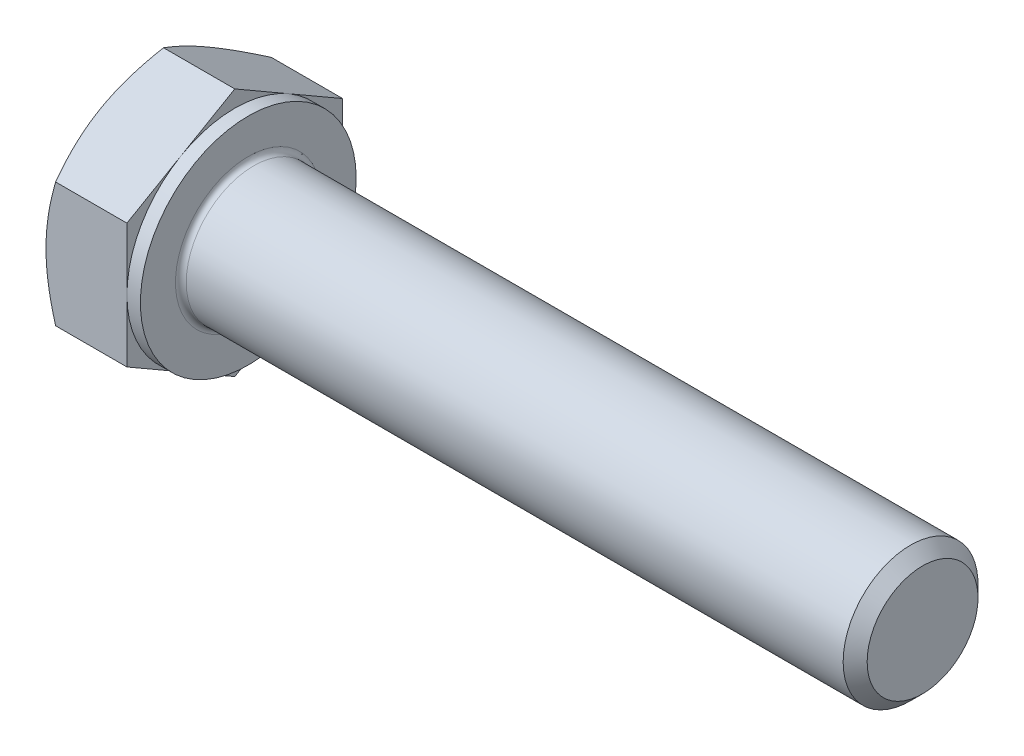
ISO-10303-21;
HEADER;
FILE_DESCRIPTION(('STEP AP214'),'2;1');
FILE_NAME('part.step','',(''),(''),'','','');
FILE_SCHEMA(('AUTOMOTIVE_DESIGN { 1 0 10303 214 1 1 1 1 }'));
ENDSEC;
DATA;
#1=APPLICATION_CONTEXT('core data for automotive mechanical design processes');
#2=APPLICATION_PROTOCOL_DEFINITION('international standard','automotive_design',2000,#1);
#3=PRODUCT_CONTEXT('',#1,'mechanical');
#4=PRODUCT('Part','Part','',(#3));
#5=PRODUCT_RELATED_PRODUCT_CATEGORY('part','',(#4));
#6=PRODUCT_DEFINITION_FORMATION('','',#4);
#7=PRODUCT_DEFINITION_CONTEXT('part definition',#1,'design');
#8=PRODUCT_DEFINITION('design','',#6,#7);
#9=PRODUCT_DEFINITION_SHAPE('','',#8);
#10=(LENGTH_UNIT() NAMED_UNIT(*) SI_UNIT(.MILLI.,.METRE.));
#11=(NAMED_UNIT(*) PLANE_ANGLE_UNIT() SI_UNIT($,.RADIAN.));
#12=(NAMED_UNIT(*) SI_UNIT($,.STERADIAN.) SOLID_ANGLE_UNIT());
#13=UNCERTAINTY_MEASURE_WITH_UNIT(LENGTH_MEASURE(1.E-05),#10,'distance_accuracy_value','');
#14=(GEOMETRIC_REPRESENTATION_CONTEXT(3) GLOBAL_UNCERTAINTY_ASSIGNED_CONTEXT((#13)) GLOBAL_UNIT_ASSIGNED_CONTEXT((#10,
#11,#12)) REPRESENTATION_CONTEXT('',''));
#15=CARTESIAN_POINT('',(0.,0.,0.));
#16=DIRECTION('',(0.,0.,1.));
#17=DIRECTION('',(1.,0.,0.));
#18=AXIS2_PLACEMENT_3D('',#15,#16,#17);
#19=CARTESIAN_POINT('',(3.5,4.61880215351701,0.));
#20=DIRECTION('',(1.,0.,0.));
#21=DIRECTION('',(0.,0.,-1.));
#22=AXIS2_PLACEMENT_3D('',#19,#20,#21);
#23=PLANE('',#22);
#24=CARTESIAN_POINT('',(3.5,0.,0.));
#25=DIRECTION('',(1.,0.,0.));
#26=DIRECTION('',(0.,0.,-1.));
#27=AXIS2_PLACEMENT_3D('',#24,#25,#26);
#28=CIRCLE('',#27,2.7);
#29=CARTESIAN_POINT('',(3.5,0.,-2.7));
#30=VERTEX_POINT('',#29);
#31=EDGE_CURVE('E43',#30,#30,#28,.F.);
#32=ORIENTED_EDGE('',*,*,#31,.T.);
#33=EDGE_LOOP('',(#32));
#34=FACE_BOUND('',#33,.T.);
#35=CARTESIAN_POINT('',(3.5,0.,0.));
#36=DIRECTION('',(1.,0.,0.));
#37=DIRECTION('',(0.,0.,-1.));
#38=AXIS2_PLACEMENT_3D('',#35,#36,#37);
#39=CIRCLE('',#38,4.);
#40=CARTESIAN_POINT('',(3.5,0.,-4.));
#41=VERTEX_POINT('',#40);
#42=EDGE_CURVE('E294',#41,#41,#39,.T.);
#43=ORIENTED_EDGE('',*,*,#42,.T.);
#44=EDGE_LOOP('',(#43));
#45=FACE_BOUND('',#44,.T.);
#46=ADVANCED_FACE('F35',(#34,#45),#23,.T.);
#47=CARTESIAN_POINT('',(0.,0.,0.));
#48=DIRECTION('',(-1.,0.,0.));
#49=DIRECTION('',(0.,0.,1.));
#50=AXIS2_PLACEMENT_3D('',#47,#48,#49);
#51=CYLINDRICAL_SURFACE('',#50,2.5);
#52=CARTESIAN_POINT('',(3.7,0.,0.));
#53=DIRECTION('',(1.,0.,0.));
#54=DIRECTION('',(0.,0.,-1.));
#55=AXIS2_PLACEMENT_3D('',#52,#53,#54);
#56=CIRCLE('',#55,2.5);
#57=CARTESIAN_POINT('',(3.7,0.,-2.5));
#58=VERTEX_POINT('',#57);
#59=EDGE_CURVE('E11',#58,#58,#56,.T.);
#60=ORIENTED_EDGE('',*,*,#59,.T.);
#61=EDGE_LOOP('',(#60));
#62=FACE_BOUND('',#61,.T.);
#63=CARTESIAN_POINT('',(28.0550000000001,0.,0.));
#64=DIRECTION('',(-1.,0.,0.));
#65=DIRECTION('',(0.,0.,1.));
#66=AXIS2_PLACEMENT_3D('',#63,#64,#65);
#67=CIRCLE('',#66,2.5);
#68=CARTESIAN_POINT('',(28.0550000000001,0.,2.5));
#69=VERTEX_POINT('',#68);
#70=EDGE_CURVE('E273',#69,#69,#67,.T.);
#71=ORIENTED_EDGE('',*,*,#70,.T.);
#72=EDGE_LOOP('',(#71));
#73=FACE_BOUND('',#72,.T.);
#74=ADVANCED_FACE('F247',(#62,#73),#51,.T.);
#75=CARTESIAN_POINT('',(28.5,0.,0.));
#76=DIRECTION('',(-1.,0.,0.));
#77=DIRECTION('',(0.,0.,1.));
#78=AXIS2_PLACEMENT_3D('',#75,#76,#77);
#79=CONICAL_SURFACE('',#78,2.055,0.785398163397513);
#80=ORIENTED_EDGE('',*,*,#70,.F.);
#81=EDGE_LOOP('',(#80));
#82=FACE_BOUND('',#81,.T.);
#83=CARTESIAN_POINT('',(28.5,0.,0.));
#84=DIRECTION('',(-1.,0.,0.));
#85=DIRECTION('',(0.,0.,1.));
#86=AXIS2_PLACEMENT_3D('',#83,#84,#85);
#87=CIRCLE('',#86,2.055);
#88=CARTESIAN_POINT('',(28.5,0.,2.055));
#89=VERTEX_POINT('',#88);
#90=EDGE_CURVE('E271',#89,#89,#87,.T.);
#91=ORIENTED_EDGE('',*,*,#90,.T.);
#92=EDGE_LOOP('',(#91));
#93=FACE_BOUND('',#92,.T.);
#94=ADVANCED_FACE('F252',(#82,#93),#79,.T.);
#95=CARTESIAN_POINT('',(28.5,0.,0.));
#96=DIRECTION('',(-1.,0.,0.));
#97=DIRECTION('',(0.,0.,1.));
#98=AXIS2_PLACEMENT_3D('',#95,#96,#97);
#99=PLANE('',#98);
#100=ORIENTED_EDGE('',*,*,#90,.F.);
#101=EDGE_LOOP('',(#100));
#102=FACE_BOUND('',#101,.T.);
#103=ADVANCED_FACE('F259',(#102),#99,.F.);
#104=CARTESIAN_POINT('',(3.,4.,0.));
#105=DIRECTION('',(1.,0.,0.));
#106=DIRECTION('',(0.,0.,-1.));
#107=AXIS2_PLACEMENT_3D('',#104,#105,#106);
#108=PLANE('',#107);
#109=DIRECTION('',(0.,0.500000000000001,0.866025403784438));
#110=VECTOR('',#109,1.);
#111=CARTESIAN_POINT('',(3.,2.3094010767585,-4.));
#112=LINE('',#111,#110);
#113=CARTESIAN_POINT('',(3.,2.3094010767585,-4.));
#114=VERTEX_POINT('',#113);
#115=CARTESIAN_POINT('',(3.,3.46410161513775,-2.00000000000001));
#116=VERTEX_POINT('',#115);
#117=EDGE_CURVE('E167',#114,#116,#112,.T.);
#118=ORIENTED_EDGE('',*,*,#117,.T.);
#119=CARTESIAN_POINT('',(3.,0.,0.));
#120=DIRECTION('',(-1.,0.,0.));
#121=DIRECTION('',(0.,0.,1.));
#122=AXIS2_PLACEMENT_3D('',#119,#120,#121);
#123=CIRCLE('',#122,4.);
#124=CARTESIAN_POINT('',(3.,0.,-4.));
#125=VERTEX_POINT('',#124);
#126=EDGE_CURVE('E50',#116,#125,#123,.T.);
#127=ORIENTED_EDGE('',*,*,#126,.T.);
#128=DIRECTION('',(0.,1.,0.));
#129=VECTOR('',#128,1.);
#130=CARTESIAN_POINT('',(3.,2.3094010767585,-4.));
#131=LINE('',#130,#129);
#132=EDGE_CURVE('E297',#125,#114,#131,.T.);
#133=ORIENTED_EDGE('',*,*,#132,.T.);
#134=EDGE_LOOP('',(#118,#127,#133));
#135=FACE_BOUND('',#134,.T.);
#136=ADVANCED_FACE('F262',(#135),#108,.T.);
#137=CARTESIAN_POINT('',(3.,4.61880215351701,0.));
#138=VERTEX_POINT('',#137);
#139=EDGE_CURVE('E165',#116,#138,#112,.T.);
#140=ORIENTED_EDGE('',*,*,#139,.T.);
#141=DIRECTION('',(0.,-0.500000000000001,0.866025403784438));
#142=VECTOR('',#141,1.);
#143=CARTESIAN_POINT('',(3.,4.61880215351701,0.));
#144=LINE('',#143,#142);
#145=CARTESIAN_POINT('',(3.,3.46410161513775,2.));
#146=VERTEX_POINT('',#145);
#147=EDGE_CURVE('E164',#138,#146,#144,.T.);
#148=ORIENTED_EDGE('',*,*,#147,.T.);
#149=EDGE_CURVE('E153',#146,#116,#123,.T.);
#150=ORIENTED_EDGE('',*,*,#149,.T.);
#151=EDGE_LOOP('',(#140,#148,#150));
#152=FACE_BOUND('',#151,.T.);
#153=ADVANCED_FACE('F267',(#152),#108,.T.);
#154=CARTESIAN_POINT('',(3.,2.30940107675851,3.99999999999999));
#155=VERTEX_POINT('',#154);
#156=EDGE_CURVE('E132',#146,#155,#144,.T.);
#157=ORIENTED_EDGE('',*,*,#156,.T.);
#158=DIRECTION('',(0.,-1.,0.));
#159=VECTOR('',#158,1.);
#160=CARTESIAN_POINT('',(3.,2.30940107675851,3.99999999999999));
#161=LINE('',#160,#159);
#162=CARTESIAN_POINT('',(3.,0.,4.));
#163=VERTEX_POINT('',#162);
#164=EDGE_CURVE('E126',#155,#163,#161,.T.);
#165=ORIENTED_EDGE('',*,*,#164,.T.);
#166=EDGE_CURVE('E130',#163,#146,#123,.T.);
#167=ORIENTED_EDGE('',*,*,#166,.T.);
#168=EDGE_LOOP('',(#157,#165,#167));
#169=FACE_BOUND('',#168,.T.);
#170=ADVANCED_FACE('F128',(#169),#108,.T.);
#171=CARTESIAN_POINT('',(3.,-2.30940107675848,3.99999999999999));
#172=VERTEX_POINT('',#171);
#173=EDGE_CURVE('E136',#163,#172,#161,.T.);
#174=ORIENTED_EDGE('',*,*,#173,.T.);
#175=DIRECTION('',(0.,-0.500000000000001,-0.866025403784438));
#176=VECTOR('',#175,1.);
#177=CARTESIAN_POINT('',(3.,-4.61880215351699,0.));
#178=LINE('',#177,#176);
#179=CARTESIAN_POINT('',(3.,-3.46410161513775,2.));
#180=VERTEX_POINT('',#179);
#181=EDGE_CURVE('E143',#172,#180,#178,.T.);
#182=ORIENTED_EDGE('',*,*,#181,.T.);
#183=EDGE_CURVE('E140',#180,#163,#123,.T.);
#184=ORIENTED_EDGE('',*,*,#183,.T.);
#185=EDGE_LOOP('',(#174,#182,#184));
#186=FACE_BOUND('',#185,.T.);
#187=ADVANCED_FACE('F141',(#186),#108,.T.);
#188=CARTESIAN_POINT('',(3.,-4.61880215351699,0.));
#189=VERTEX_POINT('',#188);
#190=EDGE_CURVE('E159',#180,#189,#178,.T.);
#191=ORIENTED_EDGE('',*,*,#190,.T.);
#192=DIRECTION('',(0.,0.499999999999998,-0.86602540378444));
#193=VECTOR('',#192,1.);
#194=CARTESIAN_POINT('',(3.,-2.3094010767585,-4.));
#195=LINE('',#194,#193);
#196=CARTESIAN_POINT('',(3.,-3.46410161513776,-1.99999999999999));
#197=VERTEX_POINT('',#196);
#198=EDGE_CURVE('E335',#189,#197,#195,.T.);
#199=ORIENTED_EDGE('',*,*,#198,.T.);
#200=EDGE_CURVE('E147',#197,#180,#123,.T.);
#201=ORIENTED_EDGE('',*,*,#200,.T.);
#202=EDGE_LOOP('',(#191,#199,#201));
#203=FACE_BOUND('',#202,.T.);
#204=ADVANCED_FACE('F336',(#203),#108,.T.);
#205=CARTESIAN_POINT('',(3.,-2.3094010767585,-4.));
#206=VERTEX_POINT('',#205);
#207=EDGE_CURVE('E154',#197,#206,#195,.T.);
#208=ORIENTED_EDGE('',*,*,#207,.T.);
#209=EDGE_CURVE('E298',#206,#125,#131,.T.);
#210=ORIENTED_EDGE('',*,*,#209,.T.);
#211=EDGE_CURVE('E305',#125,#197,#123,.T.);
#212=ORIENTED_EDGE('',*,*,#211,.T.);
#213=EDGE_LOOP('',(#208,#210,#212));
#214=FACE_BOUND('',#213,.T.);
#215=ADVANCED_FACE('F268',(#214),#108,.T.);
#216=CARTESIAN_POINT('',(0.,0.,0.));
#217=DIRECTION('',(-1.,0.,0.));
#218=DIRECTION('',(0.,0.,1.));
#219=AXIS2_PLACEMENT_3D('',#216,#217,#218);
#220=CYLINDRICAL_SURFACE('',#219,4.);
#221=ORIENTED_EDGE('',*,*,#126,.F.);
#222=ORIENTED_EDGE('',*,*,#149,.F.);
#223=ORIENTED_EDGE('',*,*,#166,.F.);
#224=ORIENTED_EDGE('',*,*,#183,.F.);
#225=ORIENTED_EDGE('',*,*,#200,.F.);
#226=ORIENTED_EDGE('',*,*,#211,.F.);
#227=EDGE_LOOP('',(#221,#222,#223,#224,#225,#226));
#228=FACE_BOUND('',#227,.T.);
#229=ORIENTED_EDGE('',*,*,#42,.F.);
#230=EDGE_LOOP('',(#229));
#231=FACE_BOUND('',#230,.T.);
#232=ADVANCED_FACE('F150',(#228,#231),#220,.T.);
#233=CARTESIAN_POINT('',(0.,4.61880215351701,0.));
#234=DIRECTION('',(1.,0.,0.));
#235=DIRECTION('',(0.,0.,-1.));
#236=AXIS2_PLACEMENT_3D('',#233,#234,#235);
#237=PLANE('',#236);
#238=CARTESIAN_POINT('',(0.,0.,0.));
#239=DIRECTION('',(1.,0.,0.));
#240=DIRECTION('',(0.,0.,-1.));
#241=AXIS2_PLACEMENT_3D('',#238,#239,#240);
#242=CIRCLE('',#241,4.);
#243=CARTESIAN_POINT('',(0.,0.,-4.));
#244=VERTEX_POINT('',#243);
#245=CARTESIAN_POINT('',(0.,3.46410161513775,-2.00000000000001));
#246=VERTEX_POINT('',#245);
#247=EDGE_CURVE('E293',#244,#246,#242,.T.);
#248=ORIENTED_EDGE('',*,*,#247,.F.);
#249=CARTESIAN_POINT('',(0.,-3.46410161513776,-1.99999999999999));
#250=VERTEX_POINT('',#249);
#251=EDGE_CURVE('E289',#250,#244,#242,.T.);
#252=ORIENTED_EDGE('',*,*,#251,.F.);
#253=CARTESIAN_POINT('',(0.,-3.46410161513775,2.));
#254=VERTEX_POINT('',#253);
#255=EDGE_CURVE('E292',#254,#250,#242,.T.);
#256=ORIENTED_EDGE('',*,*,#255,.F.);
#257=CARTESIAN_POINT('',(0.,0.,4.));
#258=VERTEX_POINT('',#257);
#259=EDGE_CURVE('E328',#258,#254,#242,.T.);
#260=ORIENTED_EDGE('',*,*,#259,.F.);
#261=CARTESIAN_POINT('',(0.,0.,0.));
#262=DIRECTION('',(-1.,0.,0.));
#263=DIRECTION('',(0.,0.,1.));
#264=AXIS2_PLACEMENT_3D('',#261,#262,#263);
#265=CIRCLE('',#264,4.);
#266=CARTESIAN_POINT('',(0.,3.46410161513775,2.));
#267=VERTEX_POINT('',#266);
#268=EDGE_CURVE('E168',#258,#267,#265,.T.);
#269=ORIENTED_EDGE('',*,*,#268,.T.);
#270=EDGE_CURVE('E351',#246,#267,#242,.T.);
#271=ORIENTED_EDGE('',*,*,#270,.F.);
#272=EDGE_LOOP('',(#248,#252,#256,#260,#269,#271));
#273=FACE_BOUND('',#272,.T.);
#274=ADVANCED_FACE('F197',(#273),#237,.F.);
#275=CARTESIAN_POINT('',(0.,0.,0.));
#276=DIRECTION('',(1.,0.,0.));
#277=DIRECTION('',(0.,0.,-1.));
#278=AXIS2_PLACEMENT_3D('',#275,#276,#277);
#279=CONICAL_SURFACE('',#278,4.,1.0471975511966);
#280=CARTESIAN_POINT('',(0.357332259074763,2.30928560670467,4.00019999999999));
#281=CARTESIAN_POINT('',(0.29871787364828,2.41077174646171,3.82442084967676));
#282=CARTESIAN_POINT('',(0.245410321462261,2.513133908835,3.64712438367361));
#283=CARTESIAN_POINT('',(0.152361670746402,2.71963072479812,3.28946140682429));
#284=CARTESIAN_POINT('',(0.112653489029703,2.82376904741905,3.10908854102984));
#285=CARTESIAN_POINT('',(0.050842215280279,3.03075510011796,2.7505781812972));
#286=CARTESIAN_POINT('',(0.0283277315228895,3.13357098372492,2.57249584706485));
#287=CARTESIAN_POINT('',(0.00145062314658324,3.33968651028529,2.21549328283349));
#288=CARTESIAN_POINT('',(-0.00293425857305535,3.44298540411435,2.03657435035589));
#289=CARTESIAN_POINT('',(0.00619007293997218,3.63600352522933,1.70225715780326));
#290=CARTESIAN_POINT('',(0.0174589539879966,3.72575165335065,1.54680884001293));
#291=CARTESIAN_POINT('',(0.0531739907981959,3.90466320392055,1.23692494436494));
#292=CARTESIAN_POINT('',(0.0776323457115357,3.99382600759479,1.08249043825587));
#293=CARTESIAN_POINT('',(0.138776064919292,4.17310641015198,0.771967672225419));
#294=CARTESIAN_POINT('',(0.175720603654867,4.26320131938132,0.615918711936895));
#295=CARTESIAN_POINT('',(0.25957007254803,4.44204742827551,0.306148164596159));
#296=CARTESIAN_POINT('',(0.306455302212743,4.53080091904967,0.15242260922622));
#297=CARTESIAN_POINT('',(0.35733225907477,4.61891762357085,-0.000200000000000259));
#298=B_SPLINE_CURVE_WITH_KNOTS('',3,(#280,#281,#282,#283,#284,#285,#286,#287,#288,#289,#290,
#291,#292,#293,#294,#295,#296,#297),.UNSPECIFIED.,.F.,.F.,(4,2,2,2,2,2,2,2,4),(0.,
0.634047835695966,1.26961969224543,1.88946157213122,2.50854226669297,3.04757825393385,
3.58711366126903,4.13861653143763,4.68903648037743),.UNSPECIFIED.);
#299=CARTESIAN_POINT('',(0.357265589908165,4.61880215351701,0.));
#300=VERTEX_POINT('',#299);
#301=EDGE_CURVE('E216',#267,#300,#298,.T.);
#302=ORIENTED_EDGE('',*,*,#301,.T.);
#303=CARTESIAN_POINT('',(0.357332259074769,4.61891762357085,0.0002));
#304=CARTESIAN_POINT('',(0.298717873648285,4.51743148381381,-0.175579150323228));
#305=CARTESIAN_POINT('',(0.245410321462265,4.41506932144052,-0.352875616326381));
#306=CARTESIAN_POINT('',(0.152361670746406,4.2085725054774,-0.710538593175707));
#307=CARTESIAN_POINT('',(0.112653489029706,4.10443418285647,-0.890911458970151));
#308=CARTESIAN_POINT('',(0.0508422152802806,3.89744813015756,-1.24942181870279));
#309=CARTESIAN_POINT('',(0.0283277315228902,3.7946322465506,-1.42750415293514));
#310=CARTESIAN_POINT('',(0.00145062314658287,3.58851671999023,-1.78450671716651));
#311=CARTESIAN_POINT('',(-0.00293425857305574,3.48521782616117,-1.9634256496441));
#312=CARTESIAN_POINT('',(0.00619007293997088,3.29219970504619,-2.29774284219673));
#313=CARTESIAN_POINT('',(0.0174589539879945,3.20245157692486,-2.45319115998707));
#314=CARTESIAN_POINT('',(0.0531739907981929,3.02354002635497,-2.76307505563506));
#315=CARTESIAN_POINT('',(0.0776323457115326,2.93437722268073,-2.91750956174413));
#316=CARTESIAN_POINT('',(0.138776064919289,2.75509682012354,-3.22803232777458));
#317=CARTESIAN_POINT('',(0.175720603654862,2.6650019108942,-3.3840812880631));
#318=CARTESIAN_POINT('',(0.259570072548025,2.48615580200001,-3.69385183540384));
#319=CARTESIAN_POINT('',(0.306455302212738,2.39740231122585,-3.84757739077378));
#320=CARTESIAN_POINT('',(0.357332259074765,2.30928560670466,-4.0002));
#321=B_SPLINE_CURVE_WITH_KNOTS('',3,(#303,#304,#305,#306,#307,#308,#309,#310,#311,#312,#313,
#314,#315,#316,#317,#318,#319,#320),.UNSPECIFIED.,.F.,.F.,(4,2,2,2,2,2,2,2,4),(0.,
0.634047835695967,1.26961969224543,1.88946157213122,2.50854226669297,3.04757825393386,
3.58711366126904,4.13861653143764,4.68903648037743),.UNSPECIFIED.);
#322=EDGE_CURVE('E58',#300,#246,#321,.T.);
#323=ORIENTED_EDGE('',*,*,#322,.T.);
#324=ORIENTED_EDGE('',*,*,#270,.T.);
#325=EDGE_LOOP('',(#302,#323,#324));
#326=FACE_BOUND('',#325,.T.);
#327=ADVANCED_FACE('F352',(#326),#279,.T.);
#328=CARTESIAN_POINT('',(2.00011120589741,-6.3020384276111,4.));
#329=CARTESIAN_POINT('',(1.91454696498874,-6.12645846908572,4.));
#330=CARTESIAN_POINT('',(1.82977515877991,-5.95048585830453,4.));
#331=CARTESIAN_POINT('',(1.66226027831944,-5.59754684504874,4.));
#332=CARTESIAN_POINT('',(1.57951750565516,-5.42058029958675,4.));
#333=CARTESIAN_POINT('',(1.41610926315702,-5.0645798535815,4.));
#334=CARTESIAN_POINT('',(1.33545672742031,-4.88553999633135,4.));
#335=CARTESIAN_POINT('',(1.17732358085362,-4.52607013308823,4.));
#336=CARTESIAN_POINT('',(1.09984282639236,-4.34564019048466,4.));
#337=CARTESIAN_POINT('',(0.946328318347805,-3.97695712450865,4.));
#338=CARTESIAN_POINT('',(0.87043270452968,-3.78864617668019,4.));
#339=CARTESIAN_POINT('',(0.724150215973379,-3.40985798992393,4.));
#340=CARTESIAN_POINT('',(0.653763945273161,-3.21938051607553,3.99999999999999));
#341=CARTESIAN_POINT('',(0.520275623504074,-2.83628177128503,3.99999999999999));
#342=CARTESIAN_POINT('',(0.457159651374145,-2.64366539864626,3.99999999999999));
#343=CARTESIAN_POINT('',(0.340171517554833,-2.25567134331567,3.99999999999999));
#344=CARTESIAN_POINT('',(0.286296547637712,-2.06029451909568,3.99999999999999));
#345=CARTESIAN_POINT('',(0.190596079795562,-1.6677501958015,3.99999999999999));
#346=CARTESIAN_POINT('',(0.148703055516459,-1.47059946092577,3.99999999999999));
#347=CARTESIAN_POINT('',(0.0792701945625757,-1.07374632347738,3.99999999999999));
#348=CARTESIAN_POINT('',(0.0517287925825685,-0.874044201614995,3.99999999999999));
#349=CARTESIAN_POINT('',(0.013551736981094,-0.475733691865649,3.99999999999999));
#350=CARTESIAN_POINT('',(0.00269106568149962,-0.277147418102497,3.99999999999999));
#351=CARTESIAN_POINT('',(-0.00180277185474003,0.120241437274135,3.99999999999999));
#352=CARTESIAN_POINT('',(0.0045643093544797,0.319044021953537,3.99999999999999));
#353=CARTESIAN_POINT('',(0.0293199842587296,0.653649133068303,3.99999999999999));
#354=CARTESIAN_POINT('',(0.0433487696608947,0.789796206499819,3.99999999999999));
#355=CARTESIAN_POINT('',(0.0786650587211727,1.0611517992991,3.99999999999999));
#356=CARTESIAN_POINT('',(0.0999534653997802,1.1963601997699,3.99999999999999));
#357=CARTESIAN_POINT('',(0.173595113230301,1.60036108975571,3.99999999999999));
#358=CARTESIAN_POINT('',(0.235713609865277,1.86739658303732,3.99999999999999));
#359=CARTESIAN_POINT('',(0.344187907647021,2.26690842404958,3.99999999999999));
#360=CARTESIAN_POINT('',(0.383434484333356,2.40143348571873,3.99999999999999));
#361=CARTESIAN_POINT('',(0.466191102609246,2.66917849490935,3.99999999999999));
#362=CARTESIAN_POINT('',(0.509701177188773,2.80239843232331,3.99999999999999));
#363=CARTESIAN_POINT('',(0.600271094434186,3.06757339383922,3.99999999999999));
#364=CARTESIAN_POINT('',(0.64732994386215,3.19952876030404,3.99999999999999));
#365=CARTESIAN_POINT('',(0.74442509663193,3.46233234223973,3.99999999999999));
#366=CARTESIAN_POINT('',(0.794461330917675,3.59318058330841,3.99999999999999));
#367=CARTESIAN_POINT('',(0.933355739925496,3.94627302392211,3.99999999999999));
#368=CARTESIAN_POINT('',(1.0245987610664,4.16757823857485,3.99999999999999));
#369=CARTESIAN_POINT('',(1.212472284956,4.60789849928791,3.99999999999999));
#370=CARTESIAN_POINT('',(1.30910339372387,4.82691328443149,3.99999999999999));
#371=CARTESIAN_POINT('',(1.50647026715799,5.26317250533755,3.99999999999999));
#372=CARTESIAN_POINT('',(1.60720747010151,5.4804162882198,3.99999999999999));
#373=CARTESIAN_POINT('',(1.81181128644257,5.91342831956034,3.99999999999999));
#374=CARTESIAN_POINT('',(1.91567799687904,6.12919652200916,3.99999999999999));
#375=CARTESIAN_POINT('',(2.12601769056008,6.55988022094133,3.99999999999999));
#376=CARTESIAN_POINT('',(2.23249454580639,6.77479382248027,3.99999999999999));
#377=CARTESIAN_POINT('',(2.44739203770408,7.20364803216284,3.99999999999999));
#378=CARTESIAN_POINT('',(2.55581269515436,7.41758862986447,3.99999999999999));
#379=CARTESIAN_POINT('',(2.88334503640577,8.05812603677695,3.99999999999999));
#380=CARTESIAN_POINT('',(3.10477549508713,8.48353660654958,3.99999999999999));
#381=CARTESIAN_POINT('',(3.52798949521967,9.28704830568598,3.99999999999999));
#382=CARTESIAN_POINT('',(3.72935795236481,9.66536913109685,3.99999999999999));
#383=CARTESIAN_POINT('',(4.13451859351915,10.4207405604373,3.99999999999999));
#384=CARTESIAN_POINT('',(4.33831092861574,10.7977910832853,3.99999999999999));
#385=CARTESIAN_POINT('',(4.74699525708428,11.5496417902084,3.99999999999999));
#386=CARTESIAN_POINT('',(4.95188119417862,11.9244452714923,3.99999999999999));
#387=CARTESIAN_POINT('',(5.36302659718326,12.6732594632005,3.99999999999999));
#388=CARTESIAN_POINT('',(5.56928595205575,13.0472702345666,3.99999999999999));
#389=CARTESIAN_POINT('',(5.7760450350038,13.42100281196,3.99999999999999));
#390=B_SPLINE_CURVE_WITH_KNOTS('',3,(#328,#329,#330,#331,#332,#333,#334,#335,#336,#337,#338,
#339,#340,#341,#342,#343,#344,#345,#346,#347,#348,#349,#350,#351,#352,#353,#354,#355,#356,#357,
#358,#359,#360,#361,#362,#363,#364,#365,#366,#367,#368,#369,#370,#371,#372,#373,#374,#375,#376,
#377,#378,#379,#380,#381,#382,#383,#384,#385,#386,#387,#388,#389),.UNSPECIFIED.,.F.,.F.,(4,2,2,
2,2,2,2,2,2,2,2,2,2,2,2,2,2,2,2,2,2,2,2,2,2,2,2,2,2,2,4),(0.,0.585964080082644,1.1720147339736,
1.76109183587771,2.35014223237614,2.95916537364922,3.56825519425103,4.17615863853846,
4.78387701983942,5.38809979056438,5.99225664601461,6.58818973021545,7.18413137397508,
7.59453803053125,8.00499575598946,8.82630884150171,9.24666973898508,9.66703388938196,
10.0872808210163,10.5075180094363,11.2255416710968,11.9436462552168,12.6620045748535,
13.3803851921263,14.0999050723894,14.8194326561991,16.2581595564571,17.5438734456803,
18.8296679016496,20.1111105471136,21.3924508191106),.UNSPECIFIED.);
#391=CARTESIAN_POINT('',(0.35726558990816,2.30940107675851,3.99999999999999));
#392=VERTEX_POINT('',#391);
#393=EDGE_CURVE('E228',#258,#392,#390,.T.);
#394=ORIENTED_EDGE('',*,*,#393,.T.);
#395=EDGE_CURVE('E227',#392,#267,#298,.T.);
#396=ORIENTED_EDGE('',*,*,#395,.T.);
#397=ORIENTED_EDGE('',*,*,#268,.F.);
#398=EDGE_LOOP('',(#394,#396,#397));
#399=FACE_BOUND('',#398,.T.);
#400=ADVANCED_FACE('F322',(#399),#279,.T.);
#401=CARTESIAN_POINT('',(0.357265589908154,-2.30940107675848,3.99999999999999));
#402=VERTEX_POINT('',#401);
#403=EDGE_CURVE('E274',#402,#258,#390,.T.);
#404=ORIENTED_EDGE('',*,*,#403,.T.);
#405=ORIENTED_EDGE('',*,*,#259,.T.);
#406=CARTESIAN_POINT('',(0.357332259074758,-4.61891762357083,-0.000200000000000507));
#407=CARTESIAN_POINT('',(0.298717873648274,-4.51743148381379,0.175579150323226));
#408=CARTESIAN_POINT('',(0.245410321462254,-4.4150693214405,0.352875616326379));
#409=CARTESIAN_POINT('',(0.152361670746395,-4.20857250547738,0.710538593175703));
#410=CARTESIAN_POINT('',(0.112653489029695,-4.10443418285645,0.890911458970147));
#411=CARTESIAN_POINT('',(0.0508422152802703,-3.89744813015755,1.24942181870278));
#412=CARTESIAN_POINT('',(0.02832773152288,-3.79463224655058,1.42750415293514));
#413=CARTESIAN_POINT('',(0.00145062314657285,-3.58851671999021,1.7845067171665));
#414=CARTESIAN_POINT('',(-0.00293425857306591,-3.48521782616116,1.96342564964409));
#415=CARTESIAN_POINT('',(0.00619007293996079,-3.29219970504617,2.29774284219672));
#416=CARTESIAN_POINT('',(0.0174589539879847,-3.20245157692485,2.45319115998706));
#417=CARTESIAN_POINT('',(0.0531739907981833,-3.02354002635495,2.76307505563505));
#418=CARTESIAN_POINT('',(0.077632345711523,-2.93437722268071,2.91750956174412));
#419=CARTESIAN_POINT('',(0.138776064919279,-2.75509682012352,3.22803232777457));
#420=CARTESIAN_POINT('',(0.175720603654853,-2.66500191089418,3.3840812880631));
#421=CARTESIAN_POINT('',(0.259570072548017,-2.48615580199999,3.69385183540383));
#422=CARTESIAN_POINT('',(0.30645530221273,-2.39740231122583,3.84757739077377));
#423=CARTESIAN_POINT('',(0.357332259074757,-2.30928560670465,4.00019999999999));
#424=B_SPLINE_CURVE_WITH_KNOTS('',3,(#406,#407,#408,#409,#410,#411,#412,#413,#414,#415,#416,
#417,#418,#419,#420,#421,#422,#423),.UNSPECIFIED.,.F.,.F.,(4,2,2,2,2,2,2,2,4),(0.,
0.634047835695964,1.26961969224543,1.88946157213122,2.50854226669296,3.04757825393385,
3.58711366126903,4.13861653143763,4.68903648037743),.UNSPECIFIED.);
#425=EDGE_CURVE('E218',#254,#402,#424,.T.);
#426=ORIENTED_EDGE('',*,*,#425,.T.);
#427=EDGE_LOOP('',(#404,#405,#426));
#428=FACE_BOUND('',#427,.T.);
#429=ADVANCED_FACE('F186',(#428),#279,.T.);
#430=CARTESIAN_POINT('',(0.357265589908154,-4.61880215351699,0.));
#431=VERTEX_POINT('',#430);
#432=EDGE_CURVE('E211',#431,#254,#424,.T.);
#433=ORIENTED_EDGE('',*,*,#432,.T.);
#434=ORIENTED_EDGE('',*,*,#255,.T.);
#435=CARTESIAN_POINT('',(0.357332259074766,-2.30928560670466,-4.0002));
#436=CARTESIAN_POINT('',(0.298717873648281,-2.4107717464617,-3.82442084967677));
#437=CARTESIAN_POINT('',(0.245410321462261,-2.51313390883499,-3.64712438367362));
#438=CARTESIAN_POINT('',(0.152361670746402,-2.71963072479811,-3.28946140682429));
#439=CARTESIAN_POINT('',(0.112653489029702,-2.82376904741904,-3.10908854102985));
#440=CARTESIAN_POINT('',(0.0508422152802768,-3.03075510011795,-2.75057818129721));
#441=CARTESIAN_POINT('',(0.0283277315228863,-3.13357098372491,-2.57249584706486));
#442=CARTESIAN_POINT('',(0.00145062314657842,-3.33968651028528,-2.21549328283349));
#443=CARTESIAN_POINT('',(-0.0029342585730608,-3.44298540411433,-2.0365743503559));
#444=CARTESIAN_POINT('',(0.00619007293996568,-3.63600352522931,-1.70225715780327));
#445=CARTESIAN_POINT('',(0.0174589539879896,-3.72575165335064,-1.54680884001293));
#446=CARTESIAN_POINT('',(0.0531739907981878,-3.90466320392053,-1.23692494436494));
#447=CARTESIAN_POINT('',(0.0776323457115271,-3.99382600759477,-1.08249043825587));
#448=CARTESIAN_POINT('',(0.138776064919282,-4.17310641015196,-0.771967672225423));
#449=CARTESIAN_POINT('',(0.175720603654856,-4.2632013193813,-0.615918711936899));
#450=CARTESIAN_POINT('',(0.259570072548018,-4.44204742827549,-0.306148164596162));
#451=CARTESIAN_POINT('',(0.306455302212731,-4.53080091904965,-0.152422609226222));
#452=CARTESIAN_POINT('',(0.357332259074758,-4.61891762357083,0.000199999999998671));
#453=B_SPLINE_CURVE_WITH_KNOTS('',3,(#435,#436,#437,#438,#439,#440,#441,#442,#443,#444,#445,
#446,#447,#448,#449,#450,#451,#452),.UNSPECIFIED.,.F.,.F.,(4,2,2,2,2,2,2,2,4),(0.,
0.634047835695966,1.26961969224543,1.88946157213122,2.50854226669297,3.04757825393385,
3.58711366126903,4.13861653143763,4.68903648037743),.UNSPECIFIED.);
#454=EDGE_CURVE('E217',#250,#431,#453,.T.);
#455=ORIENTED_EDGE('',*,*,#454,.T.);
#456=EDGE_LOOP('',(#433,#434,#455));
#457=FACE_BOUND('',#456,.T.);
#458=ADVANCED_FACE('F350',(#457),#279,.T.);
#459=CARTESIAN_POINT('',(0.357265589908161,2.3094010767585,-4.));
#460=VERTEX_POINT('',#459);
#461=EDGE_CURVE('E219',#246,#460,#321,.T.);
#462=ORIENTED_EDGE('',*,*,#461,.T.);
#463=CARTESIAN_POINT('',(2.00011120589743,-6.30203842761113,-4.));
#464=CARTESIAN_POINT('',(1.91454696498875,-6.12645846908574,-4.));
#465=CARTESIAN_POINT('',(1.82977515877992,-5.95048585830455,-4.));
#466=CARTESIAN_POINT('',(1.66226027831945,-5.59754684504877,-4.));
#467=CARTESIAN_POINT('',(1.57951750565517,-5.42058029958678,-4.));
#468=CARTESIAN_POINT('',(1.41610926315704,-5.06457985358152,-4.));
#469=CARTESIAN_POINT('',(1.33545672742033,-4.88553999633137,-4.));
#470=CARTESIAN_POINT('',(1.17732358085363,-4.52607013308825,-4.));
#471=CARTESIAN_POINT('',(1.09984282639237,-4.34564019048468,-4.));
#472=CARTESIAN_POINT('',(0.946328318347817,-3.97695712450867,-4.));
#473=CARTESIAN_POINT('',(0.870432704529692,-3.78864617668021,-4.));
#474=CARTESIAN_POINT('',(0.72415021597339,-3.40985798992395,-4.));
#475=CARTESIAN_POINT('',(0.653763945273172,-3.21938051607555,-4.));
#476=CARTESIAN_POINT('',(0.520275623504083,-2.83628177128505,-4.));
#477=CARTESIAN_POINT('',(0.457159651374155,-2.64366539864628,-4.));
#478=CARTESIAN_POINT('',(0.340171517554841,-2.25567134331569,-4.));
#479=CARTESIAN_POINT('',(0.28629654763772,-2.0602945190957,-4.));
#480=CARTESIAN_POINT('',(0.190596079795569,-1.66775019580151,-4.));
#481=CARTESIAN_POINT('',(0.148703055516466,-1.47059946092578,-4.));
#482=CARTESIAN_POINT('',(0.0792701945625821,-1.07374632347739,-4.));
#483=CARTESIAN_POINT('',(0.0517287925825741,-0.874044201615009,-4.));
#484=CARTESIAN_POINT('',(0.0135517369810985,-0.475733691865662,-4.));
#485=CARTESIAN_POINT('',(0.00269106568150377,-0.277147418102508,-4.));
#486=CARTESIAN_POINT('',(-0.00180277185473617,0.120241437274125,-4.));
#487=CARTESIAN_POINT('',(0.00456430935448359,0.319044021953528,-4.));
#488=CARTESIAN_POINT('',(0.0293199842587328,0.653649133068295,-4.));
#489=CARTESIAN_POINT('',(0.0433487696608974,0.78979620649981,-4.));
#490=CARTESIAN_POINT('',(0.078665058721175,1.06115179929909,-4.));
#491=CARTESIAN_POINT('',(0.0999534653997827,1.19636019976989,-4.));
#492=CARTESIAN_POINT('',(0.173595113230304,1.6003610897557,-4.));
#493=CARTESIAN_POINT('',(0.235713609865279,1.86739658303731,-4.));
#494=CARTESIAN_POINT('',(0.344187907647022,2.26690842404957,-4.));
#495=CARTESIAN_POINT('',(0.383434484333357,2.40143348571872,-4.));
#496=CARTESIAN_POINT('',(0.466191102609246,2.66917849490934,-4.));
#497=CARTESIAN_POINT('',(0.509701177188773,2.8023984323233,-4.));
#498=CARTESIAN_POINT('',(0.600271094434185,3.06757339383921,-4.));
#499=CARTESIAN_POINT('',(0.64732994386215,3.19952876030403,-4.));
#500=CARTESIAN_POINT('',(0.744425096631929,3.46233234223972,-4.));
#501=CARTESIAN_POINT('',(0.794461330917674,3.5931805833084,-4.));
#502=CARTESIAN_POINT('',(0.933355739925495,3.9462730239221,-4.));
#503=CARTESIAN_POINT('',(1.0245987610664,4.16757823857484,-4.));
#504=CARTESIAN_POINT('',(1.21247228495599,4.6078984992879,-4.));
#505=CARTESIAN_POINT('',(1.30910339372387,4.82691328443148,-4.));
#506=CARTESIAN_POINT('',(1.50647026715799,5.26317250533755,-4.));
#507=CARTESIAN_POINT('',(1.60720747010151,5.48041628821979,-4.));
#508=CARTESIAN_POINT('',(1.81181128644257,5.91342831956033,-4.));
#509=CARTESIAN_POINT('',(1.91567799687904,6.12919652200915,-4.));
#510=CARTESIAN_POINT('',(2.12601769056008,6.55988022094133,-4.));
#511=CARTESIAN_POINT('',(2.23249454580639,6.77479382248027,-4.));
#512=CARTESIAN_POINT('',(2.44739203770408,7.20364803216284,-4.));
#513=CARTESIAN_POINT('',(2.55581269515436,7.41758862986447,-4.));
#514=CARTESIAN_POINT('',(2.88334503640577,8.05812603677696,-4.));
#515=CARTESIAN_POINT('',(3.10477549508713,8.48353660654959,-4.));
#516=CARTESIAN_POINT('',(3.52798949521968,9.28704830568598,-4.));
#517=CARTESIAN_POINT('',(3.72935795236482,9.66536913109686,-4.));
#518=CARTESIAN_POINT('',(4.13451859351915,10.4207405604373,-4.));
#519=CARTESIAN_POINT('',(4.33831092861575,10.7977910832853,-4.));
#520=CARTESIAN_POINT('',(4.74699525708428,11.5496417902084,-4.));
#521=CARTESIAN_POINT('',(4.95188119417863,11.9244452714923,-4.));
#522=CARTESIAN_POINT('',(5.36302659718327,12.6732594632005,-4.));
#523=CARTESIAN_POINT('',(5.56928595205576,13.0472702345667,-4.));
#524=CARTESIAN_POINT('',(5.7760450350038,13.42100281196,-4.));
#525=B_SPLINE_CURVE_WITH_KNOTS('',3,(#463,#464,#465,#466,#467,#468,#469,#470,#471,#472,#473,
#474,#475,#476,#477,#478,#479,#480,#481,#482,#483,#484,#485,#486,#487,#488,#489,#490,#491,#492,
#493,#494,#495,#496,#497,#498,#499,#500,#501,#502,#503,#504,#505,#506,#507,#508,#509,#510,#511,
#512,#513,#514,#515,#516,#517,#518,#519,#520,#521,#522,#523,#524),.UNSPECIFIED.,.F.,.F.,(4,2,2,
2,2,2,2,2,2,2,2,2,2,2,2,2,2,2,2,2,2,2,2,2,2,2,2,2,2,2,4),(0.,0.585964080082647,1.17201473397361,
1.76109183587772,2.35014223237614,2.95916537364923,3.56825519425104,4.17615863853847,
4.78387701983944,5.3880997905644,5.99225664601463,6.58818973021547,7.1841313739751,
7.59453803053128,8.00499575598948,8.82630884150173,9.2466697389851,9.66703388938198,
10.0872808210163,10.5075180094363,11.2255416710968,11.9436462552169,12.6620045748536,
13.3803851921263,14.0999050723894,14.8194326561991,16.2581595564571,17.5438734456804,
18.8296679016496,20.1111105471136,21.3924508191106),.UNSPECIFIED.);
#526=EDGE_CURVE('E179',#460,#244,#525,.F.);
#527=ORIENTED_EDGE('',*,*,#526,.T.);
#528=ORIENTED_EDGE('',*,*,#247,.T.);
#529=EDGE_LOOP('',(#462,#527,#528));
#530=FACE_BOUND('',#529,.T.);
#531=ADVANCED_FACE('F347',(#530),#279,.T.);
#532=CARTESIAN_POINT('',(0.357265589908045,-2.30940107675868,-4.));
#533=VERTEX_POINT('',#532);
#534=EDGE_CURVE('E180',#533,#250,#453,.T.);
#535=ORIENTED_EDGE('',*,*,#534,.T.);
#536=ORIENTED_EDGE('',*,*,#251,.T.);
#537=EDGE_CURVE('E171',#244,#533,#525,.F.);
#538=ORIENTED_EDGE('',*,*,#537,.T.);
#539=EDGE_LOOP('',(#535,#536,#538));
#540=FACE_BOUND('',#539,.T.);
#541=ADVANCED_FACE('F195',(#540),#279,.T.);
#542=CARTESIAN_POINT('',(3.5,2.3094010767585,-4.));
#543=DIRECTION('',(0.,0.,1.));
#544=DIRECTION('',(0.,-1.,0.));
#545=AXIS2_PLACEMENT_3D('',#542,#543,#544);
#546=PLANE('',#545);
#547=ORIENTED_EDGE('',*,*,#209,.F.);
#548=DIRECTION('',(-1.,0.,0.));
#549=VECTOR('',#548,1.);
#550=CARTESIAN_POINT('',(3.5,-2.3094010767585,-4.));
#551=LINE('',#550,#549);
#552=EDGE_CURVE('E280',#206,#533,#551,.T.);
#553=ORIENTED_EDGE('',*,*,#552,.T.);
#554=ORIENTED_EDGE('',*,*,#537,.F.);
#555=ORIENTED_EDGE('',*,*,#526,.F.);
#556=DIRECTION('',(-1.,0.,0.));
#557=VECTOR('',#556,1.);
#558=CARTESIAN_POINT('',(3.5,2.3094010767585,-4.));
#559=LINE('',#558,#557);
#560=EDGE_CURVE('E276',#114,#460,#559,.T.);
#561=ORIENTED_EDGE('',*,*,#560,.F.);
#562=ORIENTED_EDGE('',*,*,#132,.F.);
#563=EDGE_LOOP('',(#547,#553,#554,#555,#561,#562));
#564=FACE_BOUND('',#563,.T.);
#565=ADVANCED_FACE('F190',(#564),#546,.F.);
#566=CARTESIAN_POINT('',(3.5,-2.3094010767585,-4.));
#567=DIRECTION('',(0.,0.86602540378444,0.499999999999998));
#568=DIRECTION('',(0.,-0.499999999999998,0.86602540378444));
#569=AXIS2_PLACEMENT_3D('',#566,#567,#568);
#570=PLANE('',#569);
#571=ORIENTED_EDGE('',*,*,#198,.F.);
#572=DIRECTION('',(-1.,0.,0.));
#573=VECTOR('',#572,1.);
#574=CARTESIAN_POINT('',(3.5,-4.61880215351699,0.));
#575=LINE('',#574,#573);
#576=EDGE_CURVE('E282',#189,#431,#575,.T.);
#577=ORIENTED_EDGE('',*,*,#576,.T.);
#578=ORIENTED_EDGE('',*,*,#454,.F.);
#579=ORIENTED_EDGE('',*,*,#534,.F.);
#580=ORIENTED_EDGE('',*,*,#552,.F.);
#581=ORIENTED_EDGE('',*,*,#207,.F.);
#582=EDGE_LOOP('',(#571,#577,#578,#579,#580,#581));
#583=FACE_BOUND('',#582,.T.);
#584=ADVANCED_FACE('F194',(#583),#570,.F.);
#585=CARTESIAN_POINT('',(3.5,-4.61880215351699,0.));
#586=DIRECTION('',(0.,0.866025403784438,-0.500000000000001));
#587=DIRECTION('',(0.,0.500000000000001,0.866025403784438));
#588=AXIS2_PLACEMENT_3D('',#585,#586,#587);
#589=PLANE('',#588);
#590=ORIENTED_EDGE('',*,*,#181,.F.);
#591=DIRECTION('',(-1.,0.,0.));
#592=VECTOR('',#591,1.);
#593=CARTESIAN_POINT('',(3.5,-2.30940107675848,3.99999999999999));
#594=LINE('',#593,#592);
#595=EDGE_CURVE('E158',#172,#402,#594,.T.);
#596=ORIENTED_EDGE('',*,*,#595,.T.);
#597=ORIENTED_EDGE('',*,*,#425,.F.);
#598=ORIENTED_EDGE('',*,*,#432,.F.);
#599=ORIENTED_EDGE('',*,*,#576,.F.);
#600=ORIENTED_EDGE('',*,*,#190,.F.);
#601=EDGE_LOOP('',(#590,#596,#597,#598,#599,#600));
#602=FACE_BOUND('',#601,.T.);
#603=ADVANCED_FACE('F202',(#602),#589,.F.);
#604=CARTESIAN_POINT('',(3.5,2.30940107675851,3.99999999999999));
#605=DIRECTION('',(0.,0.,-1.));
#606=DIRECTION('',(0.,1.,0.));
#607=AXIS2_PLACEMENT_3D('',#604,#605,#606);
#608=PLANE('',#607);
#609=ORIENTED_EDGE('',*,*,#164,.F.);
#610=DIRECTION('',(-1.,0.,0.));
#611=VECTOR('',#610,1.);
#612=CARTESIAN_POINT('',(3.5,2.30940107675851,3.99999999999999));
#613=LINE('',#612,#611);
#614=EDGE_CURVE('E285',#155,#392,#613,.T.);
#615=ORIENTED_EDGE('',*,*,#614,.T.);
#616=ORIENTED_EDGE('',*,*,#393,.F.);
#617=ORIENTED_EDGE('',*,*,#403,.F.);
#618=ORIENTED_EDGE('',*,*,#595,.F.);
#619=ORIENTED_EDGE('',*,*,#173,.F.);
#620=EDGE_LOOP('',(#609,#615,#616,#617,#618,#619));
#621=FACE_BOUND('',#620,.T.);
#622=ADVANCED_FACE('F156',(#621),#608,.F.);
#623=CARTESIAN_POINT('',(3.5,4.61880215351701,0.));
#624=DIRECTION('',(0.,-0.866025403784438,-0.500000000000001));
#625=DIRECTION('',(0.,0.500000000000001,-0.866025403784438));
#626=AXIS2_PLACEMENT_3D('',#623,#624,#625);
#627=PLANE('',#626);
#628=ORIENTED_EDGE('',*,*,#147,.F.);
#629=DIRECTION('',(-1.,0.,0.));
#630=VECTOR('',#629,1.);
#631=CARTESIAN_POINT('',(3.5,4.61880215351701,0.));
#632=LINE('',#631,#630);
#633=EDGE_CURVE('E287',#138,#300,#632,.T.);
#634=ORIENTED_EDGE('',*,*,#633,.T.);
#635=ORIENTED_EDGE('',*,*,#301,.F.);
#636=ORIENTED_EDGE('',*,*,#395,.F.);
#637=ORIENTED_EDGE('',*,*,#614,.F.);
#638=ORIENTED_EDGE('',*,*,#156,.F.);
#639=EDGE_LOOP('',(#628,#634,#635,#636,#637,#638));
#640=FACE_BOUND('',#639,.T.);
#641=ADVANCED_FACE('F233',(#640),#627,.F.);
#642=CARTESIAN_POINT('',(3.5,2.3094010767585,-4.));
#643=DIRECTION('',(0.,-0.866025403784438,0.500000000000001));
#644=DIRECTION('',(0.,-0.500000000000001,-0.866025403784438));
#645=AXIS2_PLACEMENT_3D('',#642,#643,#644);
#646=PLANE('',#645);
#647=ORIENTED_EDGE('',*,*,#117,.F.);
#648=ORIENTED_EDGE('',*,*,#560,.T.);
#649=ORIENTED_EDGE('',*,*,#461,.F.);
#650=ORIENTED_EDGE('',*,*,#322,.F.);
#651=ORIENTED_EDGE('',*,*,#633,.F.);
#652=ORIENTED_EDGE('',*,*,#139,.F.);
#653=EDGE_LOOP('',(#647,#648,#649,#650,#651,#652));
#654=FACE_BOUND('',#653,.T.);
#655=ADVANCED_FACE('F236',(#654),#646,.F.);
#656=CARTESIAN_POINT('',(3.7,0.,0.));
#657=DIRECTION('',(1.,0.,0.));
#658=DIRECTION('',(0.,0.,-1.));
#659=AXIS2_PLACEMENT_3D('',#656,#657,#658);
#660=TOROIDAL_SURFACE('',#659,2.7,0.2);
#661=ORIENTED_EDGE('',*,*,#59,.F.);
#662=EDGE_LOOP('',(#661));
#663=FACE_BOUND('',#662,.T.);
#664=ORIENTED_EDGE('',*,*,#31,.F.);
#665=EDGE_LOOP('',(#664));
#666=FACE_BOUND('',#665,.T.);
#667=ADVANCED_FACE('F37',(#663,#666),#660,.F.);
#668=CLOSED_SHELL('',(#46,#74,#94,#103,#136,#153,#170,#187,#204,#215,#232,#274,#327,#400,#429,
#458,#531,#541,#565,#584,#603,#622,#641,#655,#667));
#669=MANIFOLD_SOLID_BREP('B2',#668);
#670=ADVANCED_BREP_SHAPE_REPRESENTATION('',(#18,#669),#14);
#671=SHAPE_DEFINITION_REPRESENTATION(#9,#670);
ENDSEC;
END-ISO-10303-21;
